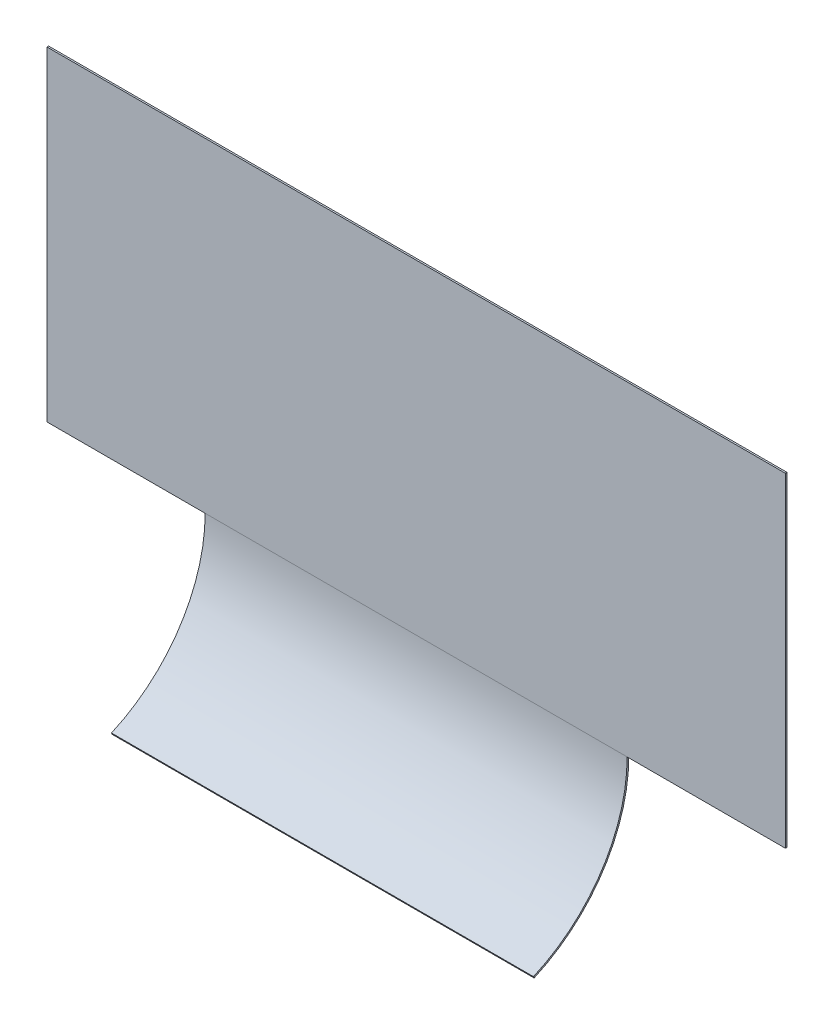
ISO-10303-21;
HEADER;
FILE_DESCRIPTION(('STEP AP214'),'2;1');
FILE_NAME('part.step','',(''),(''),'','','');
FILE_SCHEMA(('AUTOMOTIVE_DESIGN { 1 0 10303 214 1 1 1 1 }'));
ENDSEC;
DATA;
#1=APPLICATION_CONTEXT('core data for automotive mechanical design processes');
#2=APPLICATION_PROTOCOL_DEFINITION('international standard','automotive_design',2000,#1);
#3=PRODUCT_CONTEXT('',#1,'mechanical');
#4=PRODUCT('Part','Part','',(#3));
#5=PRODUCT_RELATED_PRODUCT_CATEGORY('part','',(#4));
#6=PRODUCT_DEFINITION_FORMATION('','',#4);
#7=PRODUCT_DEFINITION_CONTEXT('part definition',#1,'design');
#8=PRODUCT_DEFINITION('design','',#6,#7);
#9=PRODUCT_DEFINITION_SHAPE('','',#8);
#10=(LENGTH_UNIT() NAMED_UNIT(*) SI_UNIT(.MILLI.,.METRE.));
#11=(NAMED_UNIT(*) PLANE_ANGLE_UNIT() SI_UNIT($,.RADIAN.));
#12=(NAMED_UNIT(*) SI_UNIT($,.STERADIAN.) SOLID_ANGLE_UNIT());
#13=UNCERTAINTY_MEASURE_WITH_UNIT(LENGTH_MEASURE(1.E-05),#10,'distance_accuracy_value','');
#14=(GEOMETRIC_REPRESENTATION_CONTEXT(3) GLOBAL_UNCERTAINTY_ASSIGNED_CONTEXT((#13)) GLOBAL_UNIT_ASSIGNED_CONTEXT((#10,
#11,#12)) REPRESENTATION_CONTEXT('',''));
#15=CARTESIAN_POINT('',(0.,0.,0.));
#16=DIRECTION('',(0.,0.,1.));
#17=DIRECTION('',(1.,0.,0.));
#18=AXIS2_PLACEMENT_3D('',#15,#16,#17);
#19=CARTESIAN_POINT('',(203.2,0.,-152.4127));
#20=DIRECTION('',(0.,0.,1.));
#21=DIRECTION('',(1.,0.,0.));
#22=AXIS2_PLACEMENT_3D('',#19,#20,#21);
#23=PLANE('',#22);
#24=DIRECTION('',(0.,1.,0.));
#25=VECTOR('',#24,1.);
#26=CARTESIAN_POINT('',(-203.2,0.,-152.4127));
#27=LINE('',#26,#25);
#28=CARTESIAN_POINT('',(-203.2,0.,-152.4127));
#29=VERTEX_POINT('',#28);
#30=CARTESIAN_POINT('',(-203.2,312.7375,-152.4127));
#31=VERTEX_POINT('',#30);
#32=EDGE_CURVE('E161',#29,#31,#27,.T.);
#33=ORIENTED_EDGE('',*,*,#32,.T.);
#34=DIRECTION('',(-1.,0.,0.));
#35=VECTOR('',#34,1.);
#36=CARTESIAN_POINT('',(203.2,312.7375,-152.4127));
#37=LINE('',#36,#35);
#38=CARTESIAN_POINT('',(203.2,312.7375,-152.4127));
#39=VERTEX_POINT('',#38);
#40=EDGE_CURVE('E197',#39,#31,#37,.T.);
#41=ORIENTED_EDGE('',*,*,#40,.F.);
#42=DIRECTION('',(0.,1.,0.));
#43=VECTOR('',#42,1.);
#44=CARTESIAN_POINT('',(203.2,0.,-152.4127));
#45=LINE('',#44,#43);
#46=CARTESIAN_POINT('',(203.2,0.,-152.4127));
#47=VERTEX_POINT('',#46);
#48=EDGE_CURVE('E162',#47,#39,#45,.T.);
#49=ORIENTED_EDGE('',*,*,#48,.F.);
#50=DIRECTION('',(-1.,0.,0.));
#51=VECTOR('',#50,1.);
#52=CARTESIAN_POINT('',(203.2,0.,-152.4127));
#53=LINE('',#52,#51);
#54=EDGE_CURVE('E176',#47,#29,#53,.T.);
#55=ORIENTED_EDGE('',*,*,#54,.T.);
#56=EDGE_LOOP('',(#33,#41,#49,#55));
#57=FACE_BOUND('',#56,.T.);
#58=ADVANCED_FACE('F33',(#57),#23,.F.);
#59=CARTESIAN_POINT('',(203.2,312.7375,-150.8125));
#60=DIRECTION('',(0.,1.,0.));
#61=DIRECTION('',(0.,0.,1.));
#62=AXIS2_PLACEMENT_3D('',#59,#60,#61);
#63=PLANE('',#62);
#64=DIRECTION('',(-1.,0.,0.));
#65=VECTOR('',#64,1.);
#66=CARTESIAN_POINT('',(-355.6,312.7375,-152.4));
#67=LINE('',#66,#65);
#68=CARTESIAN_POINT('',(355.6,312.7375,-152.4));
#69=VERTEX_POINT('',#68);
#70=CARTESIAN_POINT('',(203.2,312.7375,-152.4));
#71=VERTEX_POINT('',#70);
#72=EDGE_CURVE('E122',#69,#71,#67,.T.);
#73=ORIENTED_EDGE('',*,*,#72,.T.);
#74=DIRECTION('',(0.,0.,-1.));
#75=VECTOR('',#74,1.);
#76=CARTESIAN_POINT('',(203.2,312.7375,-150.8125));
#77=LINE('',#76,#75);
#78=EDGE_CURVE('E165',#71,#39,#77,.T.);
#79=ORIENTED_EDGE('',*,*,#78,.T.);
#80=ORIENTED_EDGE('',*,*,#40,.T.);
#81=DIRECTION('',(0.,0.,-1.));
#82=VECTOR('',#81,1.);
#83=CARTESIAN_POINT('',(-203.2,312.7375,-150.8125));
#84=LINE('',#83,#82);
#85=CARTESIAN_POINT('',(-203.2,312.7375,-152.4));
#86=VERTEX_POINT('',#85);
#87=EDGE_CURVE('E179',#86,#31,#84,.T.);
#88=ORIENTED_EDGE('',*,*,#87,.F.);
#89=CARTESIAN_POINT('',(-355.6,312.7375,-152.4));
#90=VERTEX_POINT('',#89);
#91=EDGE_CURVE('E143',#86,#90,#67,.T.);
#92=ORIENTED_EDGE('',*,*,#91,.T.);
#93=DIRECTION('',(0.,0.,1.));
#94=VECTOR('',#93,1.);
#95=CARTESIAN_POINT('',(-355.6,312.7375,-152.4));
#96=LINE('',#95,#94);
#97=CARTESIAN_POINT('',(-355.6,312.7375,-150.8125));
#98=VERTEX_POINT('',#97);
#99=EDGE_CURVE('E135',#90,#98,#96,.T.);
#100=ORIENTED_EDGE('',*,*,#99,.T.);
#101=DIRECTION('',(-1.,0.,0.));
#102=VECTOR('',#101,1.);
#103=CARTESIAN_POINT('',(203.2,312.7375,-150.8125));
#104=LINE('',#103,#102);
#105=CARTESIAN_POINT('',(355.6,312.7375,-150.8125));
#106=VERTEX_POINT('',#105);
#107=EDGE_CURVE('E195',#106,#98,#104,.T.);
#108=ORIENTED_EDGE('',*,*,#107,.F.);
#109=DIRECTION('',(0.,0.,1.));
#110=VECTOR('',#109,1.);
#111=CARTESIAN_POINT('',(355.6,312.7375,-152.4));
#112=LINE('',#111,#110);
#113=EDGE_CURVE('E152',#69,#106,#112,.T.);
#114=ORIENTED_EDGE('',*,*,#113,.F.);
#115=EDGE_LOOP('',(#73,#79,#80,#88,#92,#100,#108,#114));
#116=FACE_BOUND('',#115,.T.);
#117=ADVANCED_FACE('F201',(#116),#63,.T.);
#118=CARTESIAN_POINT('',(203.2,0.,-150.8125));
#119=DIRECTION('',(0.,0.,1.));
#120=DIRECTION('',(1.,0.,0.));
#121=AXIS2_PLACEMENT_3D('',#118,#119,#120);
#122=PLANE('',#121);
#123=ORIENTED_EDGE('',*,*,#107,.T.);
#124=DIRECTION('',(0.,-1.,0.));
#125=VECTOR('',#124,1.);
#126=CARTESIAN_POINT('',(-355.6,312.7375,-150.8125));
#127=LINE('',#126,#125);
#128=CARTESIAN_POINT('',(-355.6,0.,-150.8125));
#129=VERTEX_POINT('',#128);
#130=EDGE_CURVE('E146',#98,#129,#127,.T.);
#131=ORIENTED_EDGE('',*,*,#130,.T.);
#132=DIRECTION('',(1.,0.,0.));
#133=VECTOR('',#132,1.);
#134=CARTESIAN_POINT('',(-355.6,0.,-150.8125));
#135=LINE('',#134,#133);
#136=CARTESIAN_POINT('',(-203.2,0.,-150.8125));
#137=VERTEX_POINT('',#136);
#138=EDGE_CURVE('E116',#129,#137,#135,.T.);
#139=ORIENTED_EDGE('',*,*,#138,.T.);
#140=DIRECTION('',(-1.,0.,0.));
#141=VECTOR('',#140,1.);
#142=CARTESIAN_POINT('',(203.2,0.,-150.8125));
#143=LINE('',#142,#141);
#144=CARTESIAN_POINT('',(203.2,0.,-150.8125));
#145=VERTEX_POINT('',#144);
#146=EDGE_CURVE('E193',#145,#137,#143,.T.);
#147=ORIENTED_EDGE('',*,*,#146,.F.);
#148=CARTESIAN_POINT('',(355.6,0.,-150.8125));
#149=VERTEX_POINT('',#148);
#150=EDGE_CURVE('E148',#145,#149,#135,.T.);
#151=ORIENTED_EDGE('',*,*,#150,.T.);
#152=DIRECTION('',(0.,1.,0.));
#153=VECTOR('',#152,1.);
#154=CARTESIAN_POINT('',(355.6,312.7375,-150.8125));
#155=LINE('',#154,#153);
#156=EDGE_CURVE('E136',#149,#106,#155,.T.);
#157=ORIENTED_EDGE('',*,*,#156,.T.);
#158=EDGE_LOOP('',(#123,#131,#139,#147,#151,#157));
#159=FACE_BOUND('',#158,.T.);
#160=ADVANCED_FACE('F221',(#159),#122,.T.);
#161=CARTESIAN_POINT('',(203.2,0.,0.));
#162=DIRECTION('',(-1.,0.,0.));
#163=DIRECTION('',(0.,0.,1.));
#164=AXIS2_PLACEMENT_3D('',#161,#162,#163);
#165=CYLINDRICAL_SURFACE('',#164,150.8125);
#166=CARTESIAN_POINT('',(-203.2,0.,0.));
#167=DIRECTION('',(1.,0.,0.));
#168=DIRECTION('',(0.,0.,-1.));
#169=AXIS2_PLACEMENT_3D('',#166,#167,#168);
#170=CIRCLE('',#169,150.8125);
#171=CARTESIAN_POINT('',(-203.2,-138.1125,-60.5751392899761));
#172=VERTEX_POINT('',#171);
#173=EDGE_CURVE('E181',#172,#137,#170,.T.);
#174=ORIENTED_EDGE('',*,*,#173,.F.);
#175=DIRECTION('',(-1.,0.,0.));
#176=VECTOR('',#175,1.);
#177=CARTESIAN_POINT('',(203.2,-138.1125,-60.5751392899761));
#178=LINE('',#177,#176);
#179=CARTESIAN_POINT('',(203.2,-138.1125,-60.5751392899761));
#180=VERTEX_POINT('',#179);
#181=EDGE_CURVE('E191',#180,#172,#178,.T.);
#182=ORIENTED_EDGE('',*,*,#181,.F.);
#183=CARTESIAN_POINT('',(203.2,0.,0.));
#184=DIRECTION('',(1.,0.,0.));
#185=DIRECTION('',(0.,0.,-1.));
#186=AXIS2_PLACEMENT_3D('',#183,#184,#185);
#187=CIRCLE('',#186,150.8125);
#188=EDGE_CURVE('E168',#180,#145,#187,.T.);
#189=ORIENTED_EDGE('',*,*,#188,.T.);
#190=ORIENTED_EDGE('',*,*,#146,.T.);
#191=EDGE_LOOP('',(#174,#182,#189,#190));
#192=FACE_BOUND('',#191,.T.);
#193=ADVANCED_FACE('F218',(#192),#165,.F.);
#194=CARTESIAN_POINT('',(203.2,-139.577946315789,-61.217873399495));
#195=DIRECTION('',(0.,-0.401658611122919,0.915789473684213));
#196=DIRECTION('',(0.,-0.915789473684213,-0.401658611122919));
#197=AXIS2_PLACEMENT_3D('',#194,#195,#196);
#198=PLANE('',#197);
#199=DIRECTION('',(0.,0.915789473684213,0.401658611122919));
#200=VECTOR('',#199,1.);
#201=CARTESIAN_POINT('',(-203.2,-139.577946315789,-61.217873399495));
#202=LINE('',#201,#200);
#203=CARTESIAN_POINT('',(-203.2,-139.577946315789,-61.217873399495));
#204=VERTEX_POINT('',#203);
#205=EDGE_CURVE('E183',#204,#172,#202,.T.);
#206=ORIENTED_EDGE('',*,*,#205,.F.);
#207=DIRECTION('',(-1.,0.,0.));
#208=VECTOR('',#207,1.);
#209=CARTESIAN_POINT('',(203.2,-139.577946315789,-61.217873399495));
#210=LINE('',#209,#208);
#211=CARTESIAN_POINT('',(203.2,-139.577946315789,-61.217873399495));
#212=VERTEX_POINT('',#211);
#213=EDGE_CURVE('E189',#212,#204,#210,.T.);
#214=ORIENTED_EDGE('',*,*,#213,.F.);
#215=DIRECTION('',(0.,0.915789473684213,0.401658611122919));
#216=VECTOR('',#215,1.);
#217=CARTESIAN_POINT('',(203.2,-139.577946315789,-61.217873399495));
#218=LINE('',#217,#216);
#219=EDGE_CURVE('E171',#212,#180,#218,.T.);
#220=ORIENTED_EDGE('',*,*,#219,.T.);
#221=ORIENTED_EDGE('',*,*,#181,.T.);
#222=EDGE_LOOP('',(#206,#214,#220,#221));
#223=FACE_BOUND('',#222,.T.);
#224=ADVANCED_FACE('F212',(#223),#198,.T.);
#225=CARTESIAN_POINT('',(203.2,0.,0.));
#226=DIRECTION('',(-1.,0.,0.));
#227=DIRECTION('',(0.,0.,1.));
#228=AXIS2_PLACEMENT_3D('',#225,#226,#227);
#229=CYLINDRICAL_SURFACE('',#228,152.4127);
#230=CARTESIAN_POINT('',(-203.2,0.,0.));
#231=DIRECTION('',(1.,0.,0.));
#232=DIRECTION('',(0.,0.,-1.));
#233=AXIS2_PLACEMENT_3D('',#230,#231,#232);
#234=CIRCLE('',#233,152.4127);
#235=EDGE_CURVE('E166',#204,#29,#234,.T.);
#236=ORIENTED_EDGE('',*,*,#235,.T.);
#237=ORIENTED_EDGE('',*,*,#54,.F.);
#238=CARTESIAN_POINT('',(203.2,0.,0.));
#239=DIRECTION('',(1.,0.,0.));
#240=DIRECTION('',(0.,0.,-1.));
#241=AXIS2_PLACEMENT_3D('',#238,#239,#240);
#242=CIRCLE('',#241,152.4127);
#243=EDGE_CURVE('E174',#212,#47,#242,.T.);
#244=ORIENTED_EDGE('',*,*,#243,.F.);
#245=ORIENTED_EDGE('',*,*,#213,.T.);
#246=EDGE_LOOP('',(#236,#237,#244,#245));
#247=FACE_BOUND('',#246,.T.);
#248=ADVANCED_FACE('F234',(#247),#229,.T.);
#249=CARTESIAN_POINT('',(203.2,0.,0.));
#250=DIRECTION('',(1.,0.,0.));
#251=DIRECTION('',(0.,0.,-1.));
#252=AXIS2_PLACEMENT_3D('',#249,#250,#251);
#253=PLANE('',#252);
#254=DIRECTION('',(0.,0.,-1.));
#255=VECTOR('',#254,1.);
#256=CARTESIAN_POINT('',(203.2,0.,0.));
#257=LINE('',#256,#255);
#258=CARTESIAN_POINT('',(203.2,0.,-152.4));
#259=VERTEX_POINT('',#258);
#260=EDGE_CURVE('E159',#145,#259,#257,.T.);
#261=ORIENTED_EDGE('',*,*,#260,.F.);
#262=ORIENTED_EDGE('',*,*,#188,.F.);
#263=ORIENTED_EDGE('',*,*,#219,.F.);
#264=ORIENTED_EDGE('',*,*,#243,.T.);
#265=ORIENTED_EDGE('',*,*,#48,.T.);
#266=ORIENTED_EDGE('',*,*,#78,.F.);
#267=DIRECTION('',(0.,-1.,0.));
#268=VECTOR('',#267,1.);
#269=CARTESIAN_POINT('',(203.2,0.,-152.4));
#270=LINE('',#269,#268);
#271=EDGE_CURVE('E151',#71,#259,#270,.T.);
#272=ORIENTED_EDGE('',*,*,#271,.T.);
#273=EDGE_LOOP('',(#261,#262,#263,#264,#265,#266,#272));
#274=FACE_BOUND('',#273,.T.);
#275=ADVANCED_FACE('F233',(#274),#253,.T.);
#276=CARTESIAN_POINT('',(-203.2,0.,0.));
#277=DIRECTION('',(1.,0.,0.));
#278=DIRECTION('',(0.,0.,-1.));
#279=AXIS2_PLACEMENT_3D('',#276,#277,#278);
#280=PLANE('',#279);
#281=ORIENTED_EDGE('',*,*,#173,.T.);
#282=DIRECTION('',(0.,0.,-1.));
#283=VECTOR('',#282,1.);
#284=CARTESIAN_POINT('',(-203.2,0.,0.));
#285=LINE('',#284,#283);
#286=CARTESIAN_POINT('',(-203.2,0.,-152.4));
#287=VERTEX_POINT('',#286);
#288=EDGE_CURVE('E11',#137,#287,#285,.T.);
#289=ORIENTED_EDGE('',*,*,#288,.T.);
#290=DIRECTION('',(0.,-1.,0.));
#291=VECTOR('',#290,1.);
#292=CARTESIAN_POINT('',(-203.2,0.,-152.4));
#293=LINE('',#292,#291);
#294=EDGE_CURVE('E40',#86,#287,#293,.T.);
#295=ORIENTED_EDGE('',*,*,#294,.F.);
#296=ORIENTED_EDGE('',*,*,#87,.T.);
#297=ORIENTED_EDGE('',*,*,#32,.F.);
#298=ORIENTED_EDGE('',*,*,#235,.F.);
#299=ORIENTED_EDGE('',*,*,#205,.T.);
#300=EDGE_LOOP('',(#281,#289,#295,#296,#297,#298,#299));
#301=FACE_BOUND('',#300,.T.);
#302=ADVANCED_FACE('F208',(#301),#280,.F.);
#303=CARTESIAN_POINT('',(-355.6,312.7375,-152.4));
#304=DIRECTION('',(-1.,0.,0.));
#305=DIRECTION('',(0.,-1.,0.));
#306=AXIS2_PLACEMENT_3D('',#303,#304,#305);
#307=PLANE('',#306);
#308=ORIENTED_EDGE('',*,*,#130,.F.);
#309=ORIENTED_EDGE('',*,*,#99,.F.);
#310=DIRECTION('',(0.,-1.,0.));
#311=VECTOR('',#310,1.);
#312=CARTESIAN_POINT('',(-355.6,312.7375,-152.4));
#313=LINE('',#312,#311);
#314=CARTESIAN_POINT('',(-355.6,0.,-152.4));
#315=VERTEX_POINT('',#314);
#316=EDGE_CURVE('E128',#90,#315,#313,.T.);
#317=ORIENTED_EDGE('',*,*,#316,.T.);
#318=DIRECTION('',(0.,0.,1.));
#319=VECTOR('',#318,1.);
#320=CARTESIAN_POINT('',(-355.6,0.,-152.4));
#321=LINE('',#320,#319);
#322=EDGE_CURVE('E111',#315,#129,#321,.T.);
#323=ORIENTED_EDGE('',*,*,#322,.T.);
#324=EDGE_LOOP('',(#308,#309,#317,#323));
#325=FACE_BOUND('',#324,.T.);
#326=ADVANCED_FACE('F133',(#325),#307,.T.);
#327=CARTESIAN_POINT('',(0.,0.,-152.4));
#328=DIRECTION('',(0.,0.,1.));
#329=DIRECTION('',(1.,0.,0.));
#330=AXIS2_PLACEMENT_3D('',#327,#328,#329);
#331=PLANE('',#330);
#332=ORIENTED_EDGE('',*,*,#91,.F.);
#333=ORIENTED_EDGE('',*,*,#294,.T.);
#334=DIRECTION('',(1.,0.,0.));
#335=VECTOR('',#334,1.);
#336=CARTESIAN_POINT('',(-355.6,0.,-152.4));
#337=LINE('',#336,#335);
#338=EDGE_CURVE('E114',#315,#287,#337,.T.);
#339=ORIENTED_EDGE('',*,*,#338,.F.);
#340=ORIENTED_EDGE('',*,*,#316,.F.);
#341=EDGE_LOOP('',(#332,#333,#339,#340));
#342=FACE_BOUND('',#341,.T.);
#343=ADVANCED_FACE('F127',(#342),#331,.F.);
#344=CARTESIAN_POINT('',(-355.6,0.,-152.4));
#345=DIRECTION('',(0.,-1.,0.));
#346=DIRECTION('',(0.,0.,-1.));
#347=AXIS2_PLACEMENT_3D('',#344,#345,#346);
#348=PLANE('',#347);
#349=ORIENTED_EDGE('',*,*,#288,.F.);
#350=ORIENTED_EDGE('',*,*,#138,.F.);
#351=ORIENTED_EDGE('',*,*,#322,.F.);
#352=ORIENTED_EDGE('',*,*,#338,.T.);
#353=EDGE_LOOP('',(#349,#350,#351,#352));
#354=FACE_BOUND('',#353,.T.);
#355=ADVANCED_FACE('F113',(#354),#348,.T.);
#356=CARTESIAN_POINT('',(355.6,312.7375,-152.4));
#357=DIRECTION('',(1.,0.,0.));
#358=DIRECTION('',(0.,1.,0.));
#359=AXIS2_PLACEMENT_3D('',#356,#357,#358);
#360=PLANE('',#359);
#361=ORIENTED_EDGE('',*,*,#156,.F.);
#362=DIRECTION('',(0.,0.,1.));
#363=VECTOR('',#362,1.);
#364=CARTESIAN_POINT('',(355.6,0.,-152.4));
#365=LINE('',#364,#363);
#366=CARTESIAN_POINT('',(355.6,0.,-152.4));
#367=VERTEX_POINT('',#366);
#368=EDGE_CURVE('E121',#367,#149,#365,.T.);
#369=ORIENTED_EDGE('',*,*,#368,.F.);
#370=DIRECTION('',(0.,1.,0.));
#371=VECTOR('',#370,1.);
#372=CARTESIAN_POINT('',(355.6,312.7375,-152.4));
#373=LINE('',#372,#371);
#374=EDGE_CURVE('E129',#367,#69,#373,.T.);
#375=ORIENTED_EDGE('',*,*,#374,.T.);
#376=ORIENTED_EDGE('',*,*,#113,.T.);
#377=EDGE_LOOP('',(#361,#369,#375,#376));
#378=FACE_BOUND('',#377,.T.);
#379=ADVANCED_FACE('F224',(#378),#360,.T.);
#380=ORIENTED_EDGE('',*,*,#150,.F.);
#381=ORIENTED_EDGE('',*,*,#260,.T.);
#382=EDGE_CURVE('E130',#259,#367,#337,.T.);
#383=ORIENTED_EDGE('',*,*,#382,.T.);
#384=ORIENTED_EDGE('',*,*,#368,.T.);
#385=EDGE_LOOP('',(#380,#381,#383,#384));
#386=FACE_BOUND('',#385,.T.);
#387=ADVANCED_FACE('F309',(#386),#348,.T.);
#388=ORIENTED_EDGE('',*,*,#271,.F.);
#389=ORIENTED_EDGE('',*,*,#72,.F.);
#390=ORIENTED_EDGE('',*,*,#374,.F.);
#391=ORIENTED_EDGE('',*,*,#382,.F.);
#392=EDGE_LOOP('',(#388,#389,#390,#391));
#393=FACE_BOUND('',#392,.T.);
#394=ADVANCED_FACE('F230',(#393),#331,.F.);
#395=CLOSED_SHELL('',(#58,#117,#160,#193,#224,#248,#275,#302,#326,#343,#355,#379,#387,#394));
#396=MANIFOLD_SOLID_BREP('B2',#395);
#397=ADVANCED_BREP_SHAPE_REPRESENTATION('',(#18,#396),#14);
#398=SHAPE_DEFINITION_REPRESENTATION(#9,#397);
ENDSEC;
END-ISO-10303-21;
